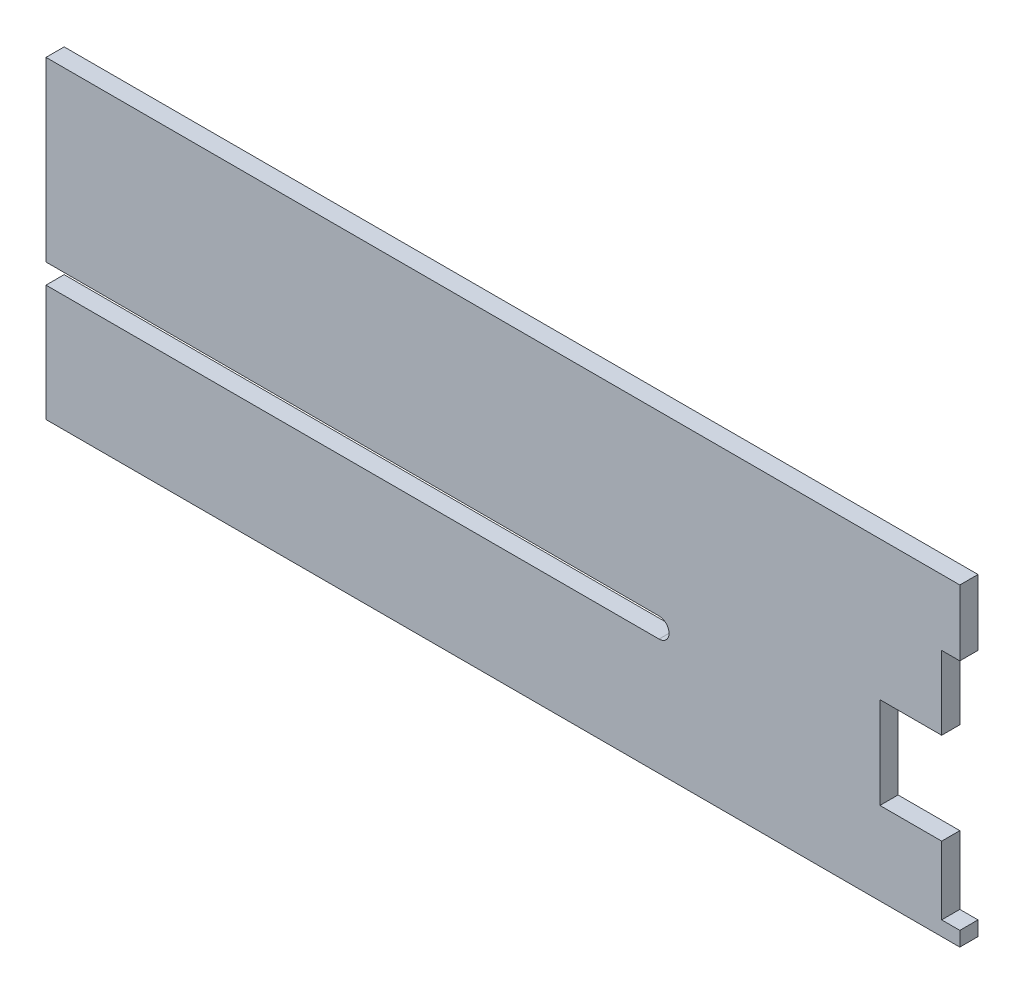
ISO-10303-21;
HEADER;
FILE_DESCRIPTION(('STEP AP214'),'2;1');
FILE_NAME('part.step','',(''),(''),'','','');
FILE_SCHEMA(('AUTOMOTIVE_DESIGN { 1 0 10303 214 1 1 1 1 }'));
ENDSEC;
DATA;
#1=APPLICATION_CONTEXT('core data for automotive mechanical design processes');
#2=APPLICATION_PROTOCOL_DEFINITION('international standard','automotive_design',2000,#1);
#3=PRODUCT_CONTEXT('',#1,'mechanical');
#4=PRODUCT('Part','Part','',(#3));
#5=PRODUCT_RELATED_PRODUCT_CATEGORY('part','',(#4));
#6=PRODUCT_DEFINITION_FORMATION('','',#4);
#7=PRODUCT_DEFINITION_CONTEXT('part definition',#1,'design');
#8=PRODUCT_DEFINITION('design','',#6,#7);
#9=PRODUCT_DEFINITION_SHAPE('','',#8);
#10=(LENGTH_UNIT() NAMED_UNIT(*) SI_UNIT(.MILLI.,.METRE.));
#11=(NAMED_UNIT(*) PLANE_ANGLE_UNIT() SI_UNIT($,.RADIAN.));
#12=(NAMED_UNIT(*) SI_UNIT($,.STERADIAN.) SOLID_ANGLE_UNIT());
#13=UNCERTAINTY_MEASURE_WITH_UNIT(LENGTH_MEASURE(1.E-05),#10,'distance_accuracy_value','');
#14=(GEOMETRIC_REPRESENTATION_CONTEXT(3) GLOBAL_UNCERTAINTY_ASSIGNED_CONTEXT((#13)) GLOBAL_UNIT_ASSIGNED_CONTEXT((#10,
#11,#12)) REPRESENTATION_CONTEXT('',''));
#15=CARTESIAN_POINT('',(0.,0.,0.));
#16=DIRECTION('',(0.,0.,1.));
#17=DIRECTION('',(1.,0.,0.));
#18=AXIS2_PLACEMENT_3D('',#15,#16,#17);
#19=CARTESIAN_POINT('',(0.,68.2477046717093,-5.));
#20=DIRECTION('',(1.,0.,0.));
#21=DIRECTION('',(0.,1.,0.));
#22=AXIS2_PLACEMENT_3D('',#19,#20,#21);
#23=PLANE('',#22);
#24=DIRECTION('',(0.,1.,0.));
#25=VECTOR('',#24,1.);
#26=CARTESIAN_POINT('',(0.,68.2477046717093,0.));
#27=LINE('',#26,#25);
#28=CARTESIAN_POINT('',(0.,68.2477046717093,0.));
#29=VERTEX_POINT('',#28);
#30=CARTESIAN_POINT('',(0.,86.3508861339648,0.));
#31=VERTEX_POINT('',#30);
#32=EDGE_CURVE('E180',#29,#31,#27,.T.);
#33=ORIENTED_EDGE('',*,*,#32,.F.);
#34=DIRECTION('',(0.,0.,1.));
#35=VECTOR('',#34,1.);
#36=CARTESIAN_POINT('',(0.,68.2477046717093,-5.));
#37=LINE('',#36,#35);
#38=CARTESIAN_POINT('',(0.,68.2477046717093,-5.));
#39=VERTEX_POINT('',#38);
#40=EDGE_CURVE('E11',#39,#29,#37,.T.);
#41=ORIENTED_EDGE('',*,*,#40,.F.);
#42=DIRECTION('',(0.,1.,0.));
#43=VECTOR('',#42,1.);
#44=CARTESIAN_POINT('',(0.,68.2477046717093,-5.));
#45=LINE('',#44,#43);
#46=CARTESIAN_POINT('',(0.,86.3508861339648,-5.));
#47=VERTEX_POINT('',#46);
#48=EDGE_CURVE('E224',#39,#47,#45,.T.);
#49=ORIENTED_EDGE('',*,*,#48,.T.);
#50=DIRECTION('',(0.,0.,1.));
#51=VECTOR('',#50,1.);
#52=CARTESIAN_POINT('',(0.,86.3508861339648,-5.));
#53=LINE('',#52,#51);
#54=EDGE_CURVE('E38',#47,#31,#53,.T.);
#55=ORIENTED_EDGE('',*,*,#54,.T.);
#56=EDGE_LOOP('',(#33,#41,#49,#55));
#57=FACE_BOUND('',#56,.T.);
#58=ADVANCED_FACE('F35',(#57),#23,.T.);
#59=CARTESIAN_POINT('',(0.,68.2477046717093,-5.));
#60=DIRECTION('',(0.,-1.,0.));
#61=DIRECTION('',(0.,0.,-1.));
#62=AXIS2_PLACEMENT_3D('',#59,#60,#61);
#63=PLANE('',#62);
#64=DIRECTION('',(1.,0.,0.));
#65=VECTOR('',#64,1.);
#66=CARTESIAN_POINT('',(0.,68.2477046717093,0.));
#67=LINE('',#66,#65);
#68=CARTESIAN_POINT('',(-5.,68.2477046717093,0.));
#69=VERTEX_POINT('',#68);
#70=EDGE_CURVE('E222',#69,#29,#67,.T.);
#71=ORIENTED_EDGE('',*,*,#70,.F.);
#72=DIRECTION('',(0.,0.,1.));
#73=VECTOR('',#72,1.);
#74=CARTESIAN_POINT('',(-5.,68.2477046717093,-5.));
#75=LINE('',#74,#73);
#76=CARTESIAN_POINT('',(-5.,68.2477046717093,-5.));
#77=VERTEX_POINT('',#76);
#78=EDGE_CURVE('E44',#77,#69,#75,.T.);
#79=ORIENTED_EDGE('',*,*,#78,.F.);
#80=DIRECTION('',(1.,0.,0.));
#81=VECTOR('',#80,1.);
#82=CARTESIAN_POINT('',(0.,68.2477046717093,-5.));
#83=LINE('',#82,#81);
#84=EDGE_CURVE('E170',#77,#39,#83,.T.);
#85=ORIENTED_EDGE('',*,*,#84,.T.);
#86=ORIENTED_EDGE('',*,*,#40,.T.);
#87=EDGE_LOOP('',(#71,#79,#85,#86));
#88=FACE_BOUND('',#87,.T.);
#89=ADVANCED_FACE('F253',(#88),#63,.T.);
#90=CARTESIAN_POINT('',(-5.,68.2477046717093,-5.));
#91=DIRECTION('',(1.,0.,0.));
#92=DIRECTION('',(0.,1.,0.));
#93=AXIS2_PLACEMENT_3D('',#90,#91,#92);
#94=PLANE('',#93);
#95=DIRECTION('',(0.,1.,0.));
#96=VECTOR('',#95,1.);
#97=CARTESIAN_POINT('',(-5.,68.2477046717093,0.));
#98=LINE('',#97,#96);
#99=CARTESIAN_POINT('',(-4.99999999999995,48.0065175981559,0.));
#100=VERTEX_POINT('',#99);
#101=EDGE_CURVE('E157',#100,#69,#98,.T.);
#102=ORIENTED_EDGE('',*,*,#101,.F.);
#103=DIRECTION('',(0.,0.,1.));
#104=VECTOR('',#103,1.);
#105=CARTESIAN_POINT('',(-4.99999999999995,48.0065175981559,-5.));
#106=LINE('',#105,#104);
#107=CARTESIAN_POINT('',(-4.99999999999995,48.0065175981559,-5.));
#108=VERTEX_POINT('',#107);
#109=EDGE_CURVE('E152',#108,#100,#106,.T.);
#110=ORIENTED_EDGE('',*,*,#109,.F.);
#111=DIRECTION('',(0.,1.,0.));
#112=VECTOR('',#111,1.);
#113=CARTESIAN_POINT('',(-5.,68.2477046717093,-5.));
#114=LINE('',#113,#112);
#115=EDGE_CURVE('E155',#108,#77,#114,.T.);
#116=ORIENTED_EDGE('',*,*,#115,.T.);
#117=ORIENTED_EDGE('',*,*,#78,.T.);
#118=EDGE_LOOP('',(#102,#110,#116,#117));
#119=FACE_BOUND('',#118,.T.);
#120=ADVANCED_FACE('F154',(#119),#94,.T.);
#121=CARTESIAN_POINT('',(-4.99999999999995,48.0065175981559,-5.));
#122=DIRECTION('',(0.,-1.,0.));
#123=DIRECTION('',(0.,0.,-1.));
#124=AXIS2_PLACEMENT_3D('',#121,#122,#123);
#125=PLANE('',#124);
#126=DIRECTION('',(1.,0.,0.));
#127=VECTOR('',#126,1.);
#128=CARTESIAN_POINT('',(-4.99999999999995,48.0065175981559,0.));
#129=LINE('',#128,#127);
#130=CARTESIAN_POINT('',(-22.,48.0065175981559,0.));
#131=VERTEX_POINT('',#130);
#132=EDGE_CURVE('E219',#131,#100,#129,.T.);
#133=ORIENTED_EDGE('',*,*,#132,.F.);
#134=DIRECTION('',(0.,0.,1.));
#135=VECTOR('',#134,1.);
#136=CARTESIAN_POINT('',(-22.,48.0065175981559,-5.));
#137=LINE('',#136,#135);
#138=CARTESIAN_POINT('',(-22.,48.0065175981559,-5.));
#139=VERTEX_POINT('',#138);
#140=EDGE_CURVE('E162',#139,#131,#137,.T.);
#141=ORIENTED_EDGE('',*,*,#140,.F.);
#142=DIRECTION('',(1.,0.,0.));
#143=VECTOR('',#142,1.);
#144=CARTESIAN_POINT('',(-4.99999999999995,48.0065175981559,-5.));
#145=LINE('',#144,#143);
#146=EDGE_CURVE('E168',#139,#108,#145,.T.);
#147=ORIENTED_EDGE('',*,*,#146,.T.);
#148=ORIENTED_EDGE('',*,*,#109,.T.);
#149=EDGE_LOOP('',(#133,#141,#147,#148));
#150=FACE_BOUND('',#149,.T.);
#151=ADVANCED_FACE('F172',(#150),#125,.T.);
#152=CARTESIAN_POINT('',(-22.,48.0065175981559,-5.));
#153=DIRECTION('',(1.,0.,0.));
#154=DIRECTION('',(0.,1.,0.));
#155=AXIS2_PLACEMENT_3D('',#152,#153,#154);
#156=PLANE('',#155);
#157=DIRECTION('',(0.,1.,0.));
#158=VECTOR('',#157,1.);
#159=CARTESIAN_POINT('',(-22.,48.0065175981559,0.));
#160=LINE('',#159,#158);
#161=CARTESIAN_POINT('',(-22.,22.7793661715773,0.));
#162=VERTEX_POINT('',#161);
#163=EDGE_CURVE('E216',#162,#131,#160,.T.);
#164=ORIENTED_EDGE('',*,*,#163,.F.);
#165=DIRECTION('',(0.,0.,1.));
#166=VECTOR('',#165,1.);
#167=CARTESIAN_POINT('',(-22.,22.7793661715773,-5.));
#168=LINE('',#167,#166);
#169=CARTESIAN_POINT('',(-22.,22.7793661715773,-5.));
#170=VERTEX_POINT('',#169);
#171=EDGE_CURVE('E228',#170,#162,#168,.T.);
#172=ORIENTED_EDGE('',*,*,#171,.F.);
#173=DIRECTION('',(0.,1.,0.));
#174=VECTOR('',#173,1.);
#175=CARTESIAN_POINT('',(-22.,48.0065175981559,-5.));
#176=LINE('',#175,#174);
#177=EDGE_CURVE('E173',#170,#139,#176,.T.);
#178=ORIENTED_EDGE('',*,*,#177,.T.);
#179=ORIENTED_EDGE('',*,*,#140,.T.);
#180=EDGE_LOOP('',(#164,#172,#178,#179));
#181=FACE_BOUND('',#180,.T.);
#182=ADVANCED_FACE('F266',(#181),#156,.T.);
#183=CARTESIAN_POINT('',(-4.99999999999995,22.7793661715774,-5.));
#184=DIRECTION('',(0.,1.,0.));
#185=DIRECTION('',(-1.,0.,0.));
#186=AXIS2_PLACEMENT_3D('',#183,#184,#185);
#187=PLANE('',#186);
#188=DIRECTION('',(-1.,0.,0.));
#189=VECTOR('',#188,1.);
#190=CARTESIAN_POINT('',(-4.99999999999995,22.7793661715774,0.));
#191=LINE('',#190,#189);
#192=CARTESIAN_POINT('',(-4.99999999999995,22.7793661715774,0.));
#193=VERTEX_POINT('',#192);
#194=EDGE_CURVE('E213',#193,#162,#191,.T.);
#195=ORIENTED_EDGE('',*,*,#194,.F.);
#196=DIRECTION('',(0.,0.,1.));
#197=VECTOR('',#196,1.);
#198=CARTESIAN_POINT('',(-4.99999999999995,22.7793661715774,-5.));
#199=LINE('',#198,#197);
#200=CARTESIAN_POINT('',(-4.99999999999995,22.7793661715774,-5.));
#201=VERTEX_POINT('',#200);
#202=EDGE_CURVE('E230',#201,#193,#199,.T.);
#203=ORIENTED_EDGE('',*,*,#202,.F.);
#204=DIRECTION('',(-1.,0.,0.));
#205=VECTOR('',#204,1.);
#206=CARTESIAN_POINT('',(-4.99999999999995,22.7793661715774,-5.));
#207=LINE('',#206,#205);
#208=EDGE_CURVE('E175',#201,#170,#207,.T.);
#209=ORIENTED_EDGE('',*,*,#208,.T.);
#210=ORIENTED_EDGE('',*,*,#171,.T.);
#211=EDGE_LOOP('',(#195,#203,#209,#210));
#212=FACE_BOUND('',#211,.T.);
#213=ADVANCED_FACE('F269',(#212),#187,.T.);
#214=CARTESIAN_POINT('',(-4.99999999999995,22.7793661715774,-5.));
#215=DIRECTION('',(1.,0.,0.));
#216=DIRECTION('',(0.,0.,-1.));
#217=AXIS2_PLACEMENT_3D('',#214,#215,#216);
#218=PLANE('',#217);
#219=DIRECTION('',(0.,1.,0.));
#220=VECTOR('',#219,1.);
#221=CARTESIAN_POINT('',(-4.99999999999995,22.7793661715774,0.));
#222=LINE('',#221,#220);
#223=CARTESIAN_POINT('',(-4.99999999999995,3.99999999999989,0.));
#224=VERTEX_POINT('',#223);
#225=EDGE_CURVE('E210',#224,#193,#222,.T.);
#226=ORIENTED_EDGE('',*,*,#225,.F.);
#227=DIRECTION('',(0.,0.,1.));
#228=VECTOR('',#227,1.);
#229=CARTESIAN_POINT('',(-4.99999999999995,3.99999999999989,-5.));
#230=LINE('',#229,#228);
#231=CARTESIAN_POINT('',(-4.99999999999995,3.99999999999989,-5.));
#232=VERTEX_POINT('',#231);
#233=EDGE_CURVE('E232',#232,#224,#230,.T.);
#234=ORIENTED_EDGE('',*,*,#233,.F.);
#235=DIRECTION('',(0.,1.,0.));
#236=VECTOR('',#235,1.);
#237=CARTESIAN_POINT('',(-4.99999999999995,8.90261500571563,-5.));
#238=LINE('',#237,#236);
#239=EDGE_CURVE('E453',#232,#201,#238,.T.);
#240=ORIENTED_EDGE('',*,*,#239,.T.);
#241=ORIENTED_EDGE('',*,*,#202,.T.);
#242=EDGE_LOOP('',(#226,#234,#240,#241));
#243=FACE_BOUND('',#242,.T.);
#244=ADVANCED_FACE('F273',(#243),#218,.T.);
#245=CARTESIAN_POINT('',(0.,3.99999999999989,-5.));
#246=DIRECTION('',(0.,1.,0.));
#247=DIRECTION('',(-1.,0.,0.));
#248=AXIS2_PLACEMENT_3D('',#245,#246,#247);
#249=PLANE('',#248);
#250=DIRECTION('',(-1.,0.,0.));
#251=VECTOR('',#250,1.);
#252=CARTESIAN_POINT('',(0.,3.99999999999989,0.));
#253=LINE('',#252,#251);
#254=CARTESIAN_POINT('',(0.,3.99999999999989,0.));
#255=VERTEX_POINT('',#254);
#256=EDGE_CURVE('E207',#255,#224,#253,.T.);
#257=ORIENTED_EDGE('',*,*,#256,.F.);
#258=DIRECTION('',(0.,0.,1.));
#259=VECTOR('',#258,1.);
#260=CARTESIAN_POINT('',(0.,3.99999999999989,-5.));
#261=LINE('',#260,#259);
#262=CARTESIAN_POINT('',(0.,3.99999999999989,-5.));
#263=VERTEX_POINT('',#262);
#264=EDGE_CURVE('E235',#263,#255,#261,.T.);
#265=ORIENTED_EDGE('',*,*,#264,.F.);
#266=DIRECTION('',(-1.,0.,0.));
#267=VECTOR('',#266,1.);
#268=CARTESIAN_POINT('',(0.,3.99999999999989,-5.));
#269=LINE('',#268,#267);
#270=EDGE_CURVE('E451',#263,#232,#269,.T.);
#271=ORIENTED_EDGE('',*,*,#270,.T.);
#272=ORIENTED_EDGE('',*,*,#233,.T.);
#273=EDGE_LOOP('',(#257,#265,#271,#272));
#274=FACE_BOUND('',#273,.T.);
#275=ADVANCED_FACE('F277',(#274),#249,.T.);
#276=CARTESIAN_POINT('',(0.,0.,-5.));
#277=DIRECTION('',(1.,0.,0.));
#278=DIRECTION('',(0.,1.,0.));
#279=AXIS2_PLACEMENT_3D('',#276,#277,#278);
#280=PLANE('',#279);
#281=DIRECTION('',(0.,1.,0.));
#282=VECTOR('',#281,1.);
#283=CARTESIAN_POINT('',(0.,0.,0.));
#284=LINE('',#283,#282);
#285=CARTESIAN_POINT('',(0.,0.,0.));
#286=VERTEX_POINT('',#285);
#287=EDGE_CURVE('E204',#286,#255,#284,.T.);
#288=ORIENTED_EDGE('',*,*,#287,.F.);
#289=DIRECTION('',(0.,0.,1.));
#290=VECTOR('',#289,1.);
#291=CARTESIAN_POINT('',(0.,0.,-5.));
#292=LINE('',#291,#290);
#293=CARTESIAN_POINT('',(0.,0.,-5.));
#294=VERTEX_POINT('',#293);
#295=EDGE_CURVE('E237',#294,#286,#292,.T.);
#296=ORIENTED_EDGE('',*,*,#295,.F.);
#297=DIRECTION('',(0.,1.,0.));
#298=VECTOR('',#297,1.);
#299=CARTESIAN_POINT('',(0.,0.,-5.));
#300=LINE('',#299,#298);
#301=EDGE_CURVE('E458',#294,#263,#300,.T.);
#302=ORIENTED_EDGE('',*,*,#301,.T.);
#303=ORIENTED_EDGE('',*,*,#264,.T.);
#304=EDGE_LOOP('',(#288,#296,#302,#303));
#305=FACE_BOUND('',#304,.T.);
#306=ADVANCED_FACE('F281',(#305),#280,.T.);
#307=CARTESIAN_POINT('',(-251.584289060524,0.,-5.));
#308=DIRECTION('',(0.,-1.,0.));
#309=DIRECTION('',(0.,0.,-1.));
#310=AXIS2_PLACEMENT_3D('',#307,#308,#309);
#311=PLANE('',#310);
#312=DIRECTION('',(1.,0.,0.));
#313=VECTOR('',#312,1.);
#314=CARTESIAN_POINT('',(-251.584289060524,0.,0.));
#315=LINE('',#314,#313);
#316=CARTESIAN_POINT('',(-251.584289060524,0.,0.));
#317=VERTEX_POINT('',#316);
#318=EDGE_CURVE('E201',#317,#286,#315,.T.);
#319=ORIENTED_EDGE('',*,*,#318,.F.);
#320=DIRECTION('',(0.,0.,1.));
#321=VECTOR('',#320,1.);
#322=CARTESIAN_POINT('',(-251.584289060524,0.,-5.));
#323=LINE('',#322,#321);
#324=CARTESIAN_POINT('',(-251.584289060524,0.,-5.));
#325=VERTEX_POINT('',#324);
#326=EDGE_CURVE('E239',#325,#317,#323,.T.);
#327=ORIENTED_EDGE('',*,*,#326,.F.);
#328=DIRECTION('',(1.,0.,0.));
#329=VECTOR('',#328,1.);
#330=CARTESIAN_POINT('',(-251.584289060524,0.,-5.));
#331=LINE('',#330,#329);
#332=EDGE_CURVE('E445',#325,#294,#331,.T.);
#333=ORIENTED_EDGE('',*,*,#332,.T.);
#334=ORIENTED_EDGE('',*,*,#295,.T.);
#335=EDGE_LOOP('',(#319,#327,#333,#334));
#336=FACE_BOUND('',#335,.T.);
#337=ADVANCED_FACE('F285',(#336),#311,.T.);
#338=CARTESIAN_POINT('',(-251.584289060524,32.048381086818,-5.));
#339=DIRECTION('',(-1.,0.,0.));
#340=DIRECTION('',(0.,0.,1.));
#341=AXIS2_PLACEMENT_3D('',#338,#339,#340);
#342=PLANE('',#341);
#343=DIRECTION('',(0.,-1.,0.));
#344=VECTOR('',#343,1.);
#345=CARTESIAN_POINT('',(-251.584289060524,32.048381086818,0.));
#346=LINE('',#345,#344);
#347=CARTESIAN_POINT('',(-251.584289060524,32.048381086818,0.));
#348=VERTEX_POINT('',#347);
#349=EDGE_CURVE('E198',#348,#317,#346,.T.);
#350=ORIENTED_EDGE('',*,*,#349,.F.);
#351=DIRECTION('',(0.,0.,1.));
#352=VECTOR('',#351,1.);
#353=CARTESIAN_POINT('',(-251.584289060524,32.048381086818,-5.));
#354=LINE('',#353,#352);
#355=CARTESIAN_POINT('',(-251.584289060524,32.048381086818,-5.));
#356=VERTEX_POINT('',#355);
#357=EDGE_CURVE('E241',#356,#348,#354,.T.);
#358=ORIENTED_EDGE('',*,*,#357,.F.);
#359=DIRECTION('',(0.,-1.,0.));
#360=VECTOR('',#359,1.);
#361=CARTESIAN_POINT('',(-251.584289060524,32.048381086818,-5.));
#362=LINE('',#361,#360);
#363=EDGE_CURVE('E441',#356,#325,#362,.T.);
#364=ORIENTED_EDGE('',*,*,#363,.T.);
#365=ORIENTED_EDGE('',*,*,#326,.T.);
#366=EDGE_LOOP('',(#350,#358,#364,#365));
#367=FACE_BOUND('',#366,.T.);
#368=ADVANCED_FACE('F289',(#367),#342,.T.);
#369=CARTESIAN_POINT('',(-251.584289060524,32.048381086818,-5.));
#370=DIRECTION('',(0.,1.,0.));
#371=DIRECTION('',(0.,0.,1.));
#372=AXIS2_PLACEMENT_3D('',#369,#370,#371);
#373=PLANE('',#372);
#374=DIRECTION('',(-1.,0.,0.));
#375=VECTOR('',#374,1.);
#376=CARTESIAN_POINT('',(-251.584289060524,32.048381086818,0.));
#377=LINE('',#376,#375);
#378=CARTESIAN_POINT('',(-82.8102231584948,32.048381086818,0.));
#379=VERTEX_POINT('',#378);
#380=EDGE_CURVE('E195',#379,#348,#377,.T.);
#381=ORIENTED_EDGE('',*,*,#380,.F.);
#382=DIRECTION('',(0.,0.,1.));
#383=VECTOR('',#382,1.);
#384=CARTESIAN_POINT('',(-82.8102231584948,32.048381086818,-5.));
#385=LINE('',#384,#383);
#386=CARTESIAN_POINT('',(-82.8102231584948,32.048381086818,-5.));
#387=VERTEX_POINT('',#386);
#388=EDGE_CURVE('E243',#387,#379,#385,.T.);
#389=ORIENTED_EDGE('',*,*,#388,.F.);
#390=DIRECTION('',(-1.,0.,0.));
#391=VECTOR('',#390,1.);
#392=CARTESIAN_POINT('',(-251.584289060524,32.048381086818,-5.));
#393=LINE('',#392,#391);
#394=EDGE_CURVE('E464',#387,#356,#393,.T.);
#395=ORIENTED_EDGE('',*,*,#394,.T.);
#396=ORIENTED_EDGE('',*,*,#357,.T.);
#397=EDGE_LOOP('',(#381,#389,#395,#396));
#398=FACE_BOUND('',#397,.T.);
#399=ADVANCED_FACE('F293',(#398),#373,.T.);
#400=CARTESIAN_POINT('',(-82.8102231584948,34.798381086818,-5.));
#401=DIRECTION('',(0.,0.,1.));
#402=DIRECTION('',(1.,0.,0.));
#403=AXIS2_PLACEMENT_3D('',#400,#401,#402);
#404=CYLINDRICAL_SURFACE('',#403,2.75);
#405=CARTESIAN_POINT('',(-82.8102231584948,34.798381086818,0.));
#406=DIRECTION('',(0.,0.,-1.));
#407=DIRECTION('',(1.,0.,0.));
#408=AXIS2_PLACEMENT_3D('',#405,#406,#407);
#409=CIRCLE('',#408,2.75);
#410=CARTESIAN_POINT('',(-82.8102231584948,37.548381086818,0.));
#411=VERTEX_POINT('',#410);
#412=EDGE_CURVE('E192',#411,#379,#409,.T.);
#413=ORIENTED_EDGE('',*,*,#412,.F.);
#414=DIRECTION('',(0.,0.,1.));
#415=VECTOR('',#414,1.);
#416=CARTESIAN_POINT('',(-82.8102231584948,37.548381086818,-5.));
#417=LINE('',#416,#415);
#418=CARTESIAN_POINT('',(-82.8102231584948,37.548381086818,-5.));
#419=VERTEX_POINT('',#418);
#420=EDGE_CURVE('E245',#419,#411,#417,.T.);
#421=ORIENTED_EDGE('',*,*,#420,.F.);
#422=CARTESIAN_POINT('',(-82.8102231584948,34.798381086818,-5.));
#423=DIRECTION('',(0.,0.,-1.));
#424=DIRECTION('',(1.,0.,0.));
#425=AXIS2_PLACEMENT_3D('',#422,#423,#424);
#426=CIRCLE('',#425,2.75);
#427=EDGE_CURVE('E434',#419,#387,#426,.T.);
#428=ORIENTED_EDGE('',*,*,#427,.T.);
#429=ORIENTED_EDGE('',*,*,#388,.T.);
#430=EDGE_LOOP('',(#413,#421,#428,#429));
#431=FACE_BOUND('',#430,.T.);
#432=ADVANCED_FACE('F297',(#431),#404,.F.);
#433=CARTESIAN_POINT('',(-251.584289060524,37.548381086818,-5.));
#434=DIRECTION('',(0.,-1.,0.));
#435=DIRECTION('',(0.,0.,-1.));
#436=AXIS2_PLACEMENT_3D('',#433,#434,#435);
#437=PLANE('',#436);
#438=DIRECTION('',(1.,0.,0.));
#439=VECTOR('',#438,1.);
#440=CARTESIAN_POINT('',(-251.584289060524,37.548381086818,0.));
#441=LINE('',#440,#439);
#442=CARTESIAN_POINT('',(-251.584289060524,37.548381086818,0.));
#443=VERTEX_POINT('',#442);
#444=EDGE_CURVE('E189',#443,#411,#441,.T.);
#445=ORIENTED_EDGE('',*,*,#444,.F.);
#446=DIRECTION('',(0.,0.,1.));
#447=VECTOR('',#446,1.);
#448=CARTESIAN_POINT('',(-251.584289060524,37.548381086818,-5.));
#449=LINE('',#448,#447);
#450=CARTESIAN_POINT('',(-251.584289060524,37.548381086818,-5.));
#451=VERTEX_POINT('',#450);
#452=EDGE_CURVE('E247',#451,#443,#449,.T.);
#453=ORIENTED_EDGE('',*,*,#452,.F.);
#454=DIRECTION('',(1.,0.,0.));
#455=VECTOR('',#454,1.);
#456=CARTESIAN_POINT('',(-251.584289060524,37.548381086818,-5.));
#457=LINE('',#456,#455);
#458=EDGE_CURVE('E430',#451,#419,#457,.T.);
#459=ORIENTED_EDGE('',*,*,#458,.T.);
#460=ORIENTED_EDGE('',*,*,#420,.T.);
#461=EDGE_LOOP('',(#445,#453,#459,#460));
#462=FACE_BOUND('',#461,.T.);
#463=ADVANCED_FACE('F301',(#462),#437,.T.);
#464=CARTESIAN_POINT('',(-251.584289060524,86.3508861339649,-5.));
#465=DIRECTION('',(-1.,0.,0.));
#466=DIRECTION('',(0.,0.,1.));
#467=AXIS2_PLACEMENT_3D('',#464,#465,#466);
#468=PLANE('',#467);
#469=DIRECTION('',(0.,-1.,0.));
#470=VECTOR('',#469,1.);
#471=CARTESIAN_POINT('',(-251.584289060524,86.3508861339649,0.));
#472=LINE('',#471,#470);
#473=CARTESIAN_POINT('',(-251.584289060524,86.3508861339649,0.));
#474=VERTEX_POINT('',#473);
#475=EDGE_CURVE('E186',#474,#443,#472,.T.);
#476=ORIENTED_EDGE('',*,*,#475,.F.);
#477=DIRECTION('',(0.,0.,1.));
#478=VECTOR('',#477,1.);
#479=CARTESIAN_POINT('',(-251.584289060524,86.3508861339649,-5.));
#480=LINE('',#479,#478);
#481=CARTESIAN_POINT('',(-251.584289060524,86.3508861339649,-5.));
#482=VERTEX_POINT('',#481);
#483=EDGE_CURVE('E248',#482,#474,#480,.T.);
#484=ORIENTED_EDGE('',*,*,#483,.F.);
#485=DIRECTION('',(0.,-1.,0.));
#486=VECTOR('',#485,1.);
#487=CARTESIAN_POINT('',(-251.584289060524,86.3508861339649,-5.));
#488=LINE('',#487,#486);
#489=EDGE_CURVE('E468',#482,#451,#488,.T.);
#490=ORIENTED_EDGE('',*,*,#489,.T.);
#491=ORIENTED_EDGE('',*,*,#452,.T.);
#492=EDGE_LOOP('',(#476,#484,#490,#491));
#493=FACE_BOUND('',#492,.T.);
#494=ADVANCED_FACE('F305',(#493),#468,.T.);
#495=CARTESIAN_POINT('',(-251.584289060524,86.3508861339649,-5.));
#496=DIRECTION('',(0.,1.,0.));
#497=DIRECTION('',(-1.,0.,0.));
#498=AXIS2_PLACEMENT_3D('',#495,#496,#497);
#499=PLANE('',#498);
#500=DIRECTION('',(-1.,0.,0.));
#501=VECTOR('',#500,1.);
#502=CARTESIAN_POINT('',(-251.584289060524,86.3508861339649,0.));
#503=LINE('',#502,#501);
#504=EDGE_CURVE('E183',#31,#474,#503,.T.);
#505=ORIENTED_EDGE('',*,*,#504,.F.);
#506=ORIENTED_EDGE('',*,*,#54,.F.);
#507=DIRECTION('',(-1.,0.,0.));
#508=VECTOR('',#507,1.);
#509=CARTESIAN_POINT('',(-251.584289060524,86.3508861339649,-5.));
#510=LINE('',#509,#508);
#511=EDGE_CURVE('E470',#47,#482,#510,.T.);
#512=ORIENTED_EDGE('',*,*,#511,.T.);
#513=ORIENTED_EDGE('',*,*,#483,.T.);
#514=EDGE_LOOP('',(#505,#506,#512,#513));
#515=FACE_BOUND('',#514,.T.);
#516=ADVANCED_FACE('F250',(#515),#499,.T.);
#517=CARTESIAN_POINT('',(-82.8102231584948,34.798381086818,-5.));
#518=DIRECTION('',(0.,0.,1.));
#519=DIRECTION('',(1.,0.,0.));
#520=AXIS2_PLACEMENT_3D('',#517,#518,#519);
#521=PLANE('',#520);
#522=ORIENTED_EDGE('',*,*,#48,.F.);
#523=ORIENTED_EDGE('',*,*,#84,.F.);
#524=ORIENTED_EDGE('',*,*,#115,.F.);
#525=ORIENTED_EDGE('',*,*,#146,.F.);
#526=ORIENTED_EDGE('',*,*,#177,.F.);
#527=ORIENTED_EDGE('',*,*,#208,.F.);
#528=ORIENTED_EDGE('',*,*,#239,.F.);
#529=ORIENTED_EDGE('',*,*,#270,.F.);
#530=ORIENTED_EDGE('',*,*,#301,.F.);
#531=ORIENTED_EDGE('',*,*,#332,.F.);
#532=ORIENTED_EDGE('',*,*,#363,.F.);
#533=ORIENTED_EDGE('',*,*,#394,.F.);
#534=ORIENTED_EDGE('',*,*,#427,.F.);
#535=ORIENTED_EDGE('',*,*,#458,.F.);
#536=ORIENTED_EDGE('',*,*,#489,.F.);
#537=ORIENTED_EDGE('',*,*,#511,.F.);
#538=EDGE_LOOP('',(#522,#523,#524,#525,#526,#527,#528,#529,#530,#531,#532,#533,#534,#535,#536,#537));
#539=FACE_BOUND('',#538,.T.);
#540=ADVANCED_FACE('F166',(#539),#521,.F.);
#541=CARTESIAN_POINT('',(-82.8102231584948,34.798381086818,0.));
#542=DIRECTION('',(0.,0.,1.));
#543=DIRECTION('',(1.,0.,0.));
#544=AXIS2_PLACEMENT_3D('',#541,#542,#543);
#545=PLANE('',#544);
#546=ORIENTED_EDGE('',*,*,#32,.T.);
#547=ORIENTED_EDGE('',*,*,#504,.T.);
#548=ORIENTED_EDGE('',*,*,#475,.T.);
#549=ORIENTED_EDGE('',*,*,#444,.T.);
#550=ORIENTED_EDGE('',*,*,#412,.T.);
#551=ORIENTED_EDGE('',*,*,#380,.T.);
#552=ORIENTED_EDGE('',*,*,#349,.T.);
#553=ORIENTED_EDGE('',*,*,#318,.T.);
#554=ORIENTED_EDGE('',*,*,#287,.T.);
#555=ORIENTED_EDGE('',*,*,#256,.T.);
#556=ORIENTED_EDGE('',*,*,#225,.T.);
#557=ORIENTED_EDGE('',*,*,#194,.T.);
#558=ORIENTED_EDGE('',*,*,#163,.T.);
#559=ORIENTED_EDGE('',*,*,#132,.T.);
#560=ORIENTED_EDGE('',*,*,#101,.T.);
#561=ORIENTED_EDGE('',*,*,#70,.T.);
#562=EDGE_LOOP('',(#546,#547,#548,#549,#550,#551,#552,#553,#554,#555,#556,#557,#558,#559,#560,#561));
#563=FACE_BOUND('',#562,.T.);
#564=ADVANCED_FACE('F252',(#563),#545,.T.);
#565=CLOSED_SHELL('',(#58,#89,#120,#151,#182,#213,#244,#275,#306,#337,#368,#399,#432,#463,#494,
#516,#540,#564));
#566=MANIFOLD_SOLID_BREP('B2',#565);
#567=ADVANCED_BREP_SHAPE_REPRESENTATION('',(#18,#566),#14);
#568=SHAPE_DEFINITION_REPRESENTATION(#9,#567);
ENDSEC;
END-ISO-10303-21;
